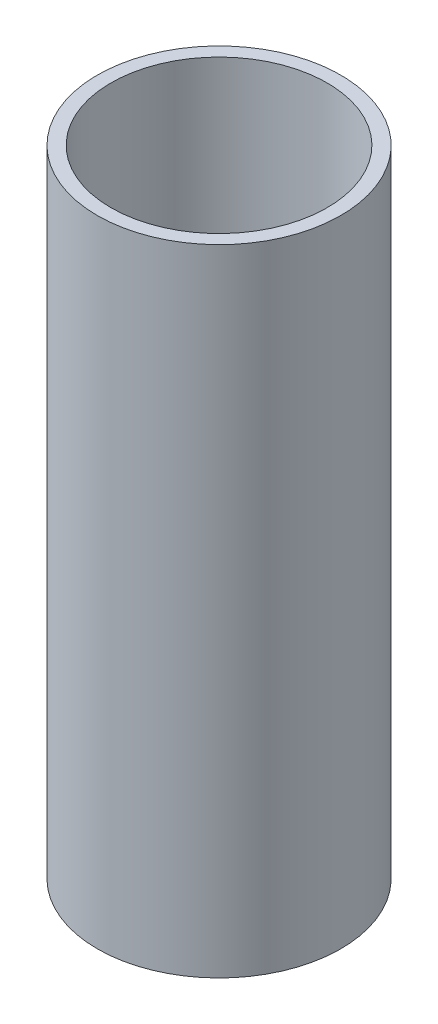
ISO-10303-21;
HEADER;
FILE_DESCRIPTION(('STEP AP214'),'2;1');
FILE_NAME('part.step','',(''),(''),'','','');
FILE_SCHEMA(('AUTOMOTIVE_DESIGN { 1 0 10303 214 1 1 1 1 }'));
ENDSEC;
DATA;
#1=APPLICATION_CONTEXT('core data for automotive mechanical design processes');
#2=APPLICATION_PROTOCOL_DEFINITION('international standard','automotive_design',2000,#1);
#3=PRODUCT_CONTEXT('',#1,'mechanical');
#4=PRODUCT('Part','Part','',(#3));
#5=PRODUCT_RELATED_PRODUCT_CATEGORY('part','',(#4));
#6=PRODUCT_DEFINITION_FORMATION('','',#4);
#7=PRODUCT_DEFINITION_CONTEXT('part definition',#1,'design');
#8=PRODUCT_DEFINITION('design','',#6,#7);
#9=PRODUCT_DEFINITION_SHAPE('','',#8);
#10=(LENGTH_UNIT() NAMED_UNIT(*) SI_UNIT(.MILLI.,.METRE.));
#11=(NAMED_UNIT(*) PLANE_ANGLE_UNIT() SI_UNIT($,.RADIAN.));
#12=(NAMED_UNIT(*) SI_UNIT($,.STERADIAN.) SOLID_ANGLE_UNIT());
#13=UNCERTAINTY_MEASURE_WITH_UNIT(LENGTH_MEASURE(1.E-05),#10,'distance_accuracy_value','');
#14=(GEOMETRIC_REPRESENTATION_CONTEXT(3) GLOBAL_UNCERTAINTY_ASSIGNED_CONTEXT((#13)) GLOBAL_UNIT_ASSIGNED_CONTEXT((#10,
#11,#12)) REPRESENTATION_CONTEXT('',''));
#15=CARTESIAN_POINT('',(0.,0.,0.));
#16=DIRECTION('',(0.,0.,1.));
#17=DIRECTION('',(1.,0.,0.));
#18=AXIS2_PLACEMENT_3D('',#15,#16,#17);
#19=CARTESIAN_POINT('',(0.,221.795816501031,0.));
#20=DIRECTION('',(0.,-1.,0.));
#21=DIRECTION('',(0.,0.,-1.));
#22=AXIS2_PLACEMENT_3D('',#19,#20,#21);
#23=CYLINDRICAL_SURFACE('',#22,42.5);
#24=CARTESIAN_POINT('',(0.,221.795816501031,0.));
#25=DIRECTION('',(0.,1.,0.));
#26=DIRECTION('',(0.,0.,1.));
#27=AXIS2_PLACEMENT_3D('',#24,#25,#26);
#28=CIRCLE('',#27,42.5);
#29=CARTESIAN_POINT('',(0.,221.795816501031,42.5));
#30=VERTEX_POINT('',#29);
#31=EDGE_CURVE('E10',#30,#30,#28,.T.);
#32=ORIENTED_EDGE('',*,*,#31,.F.);
#33=EDGE_LOOP('',(#32));
#34=FACE_BOUND('',#33,.T.);
#35=CARTESIAN_POINT('',(0.,0.,0.));
#36=DIRECTION('',(0.,1.,0.));
#37=DIRECTION('',(0.,0.,1.));
#38=AXIS2_PLACEMENT_3D('',#35,#36,#37);
#39=CIRCLE('',#38,42.5);
#40=CARTESIAN_POINT('',(0.,0.,42.5));
#41=VERTEX_POINT('',#40);
#42=EDGE_CURVE('E37',#41,#41,#39,.T.);
#43=ORIENTED_EDGE('',*,*,#42,.T.);
#44=EDGE_LOOP('',(#43));
#45=FACE_BOUND('',#44,.T.);
#46=ADVANCED_FACE('F40',(#34,#45),#23,.T.);
#47=CARTESIAN_POINT('',(0.,221.795816501031,0.));
#48=DIRECTION('',(0.,1.,0.));
#49=DIRECTION('',(0.,0.,1.));
#50=AXIS2_PLACEMENT_3D('',#47,#48,#49);
#51=PLANE('',#50);
#52=CARTESIAN_POINT('',(0.,221.795816501031,0.));
#53=DIRECTION('',(0.,1.,0.));
#54=DIRECTION('',(0.,0.,1.));
#55=AXIS2_PLACEMENT_3D('',#52,#53,#54);
#56=CIRCLE('',#55,37.757536013244);
#57=CARTESIAN_POINT('',(0.,221.795816501031,37.757536013244));
#58=VERTEX_POINT('',#57);
#59=EDGE_CURVE('E50',#58,#58,#56,.T.);
#60=ORIENTED_EDGE('',*,*,#59,.F.);
#61=EDGE_LOOP('',(#60));
#62=FACE_BOUND('',#61,.T.);
#63=ORIENTED_EDGE('',*,*,#31,.T.);
#64=EDGE_LOOP('',(#63));
#65=FACE_BOUND('',#64,.T.);
#66=ADVANCED_FACE('F59',(#62,#65),#51,.T.);
#67=CARTESIAN_POINT('',(0.,0.,0.));
#68=DIRECTION('',(0.,1.,0.));
#69=DIRECTION('',(0.,0.,1.));
#70=AXIS2_PLACEMENT_3D('',#67,#68,#69);
#71=PLANE('',#70);
#72=CARTESIAN_POINT('',(0.,0.,0.));
#73=DIRECTION('',(0.,1.,0.));
#74=DIRECTION('',(0.,0.,1.));
#75=AXIS2_PLACEMENT_3D('',#72,#73,#74);
#76=CIRCLE('',#75,37.757536013244);
#77=CARTESIAN_POINT('',(0.,0.,37.757536013244));
#78=VERTEX_POINT('',#77);
#79=EDGE_CURVE('E47',#78,#78,#76,.T.);
#80=ORIENTED_EDGE('',*,*,#79,.T.);
#81=EDGE_LOOP('',(#80));
#82=FACE_BOUND('',#81,.T.);
#83=ORIENTED_EDGE('',*,*,#42,.F.);
#84=EDGE_LOOP('',(#83));
#85=FACE_BOUND('',#84,.T.);
#86=ADVANCED_FACE('F58',(#82,#85),#71,.F.);
#87=CARTESIAN_POINT('',(0.,221.795816501031,0.));
#88=DIRECTION('',(0.,-1.,0.));
#89=DIRECTION('',(0.,0.,-1.));
#90=AXIS2_PLACEMENT_3D('',#87,#88,#89);
#91=CYLINDRICAL_SURFACE('',#90,37.757536013244);
#92=ORIENTED_EDGE('',*,*,#59,.T.);
#93=EDGE_LOOP('',(#92));
#94=FACE_BOUND('',#93,.T.);
#95=ORIENTED_EDGE('',*,*,#79,.F.);
#96=EDGE_LOOP('',(#95));
#97=FACE_BOUND('',#96,.T.);
#98=ADVANCED_FACE('F54',(#94,#97),#91,.F.);
#99=CLOSED_SHELL('',(#46,#66,#86,#98));
#100=MANIFOLD_SOLID_BREP('B2',#99);
#101=ADVANCED_BREP_SHAPE_REPRESENTATION('',(#18,#100),#14);
#102=SHAPE_DEFINITION_REPRESENTATION(#9,#101);
ENDSEC;
END-ISO-10303-21;
